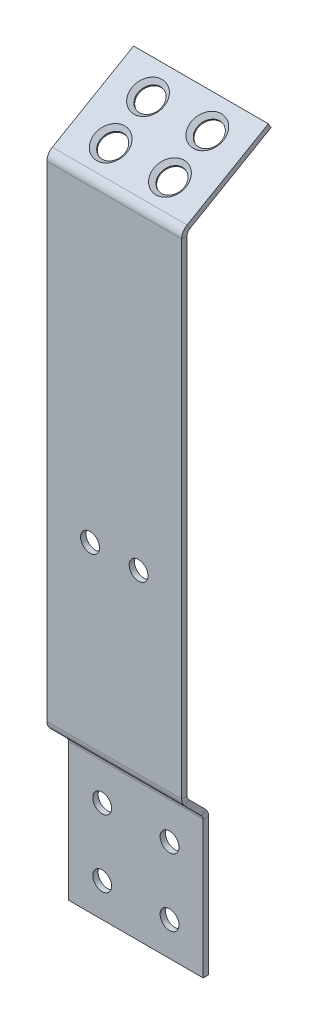
ISO-10303-21;
HEADER;
FILE_DESCRIPTION(('STEP AP214'),'2;1');
FILE_NAME('part.step','',(''),(''),'','','');
FILE_SCHEMA(('AUTOMOTIVE_DESIGN { 1 0 10303 214 1 1 1 1 }'));
ENDSEC;
DATA;
#1=APPLICATION_CONTEXT('core data for automotive mechanical design processes');
#2=APPLICATION_PROTOCOL_DEFINITION('international standard','automotive_design',2000,#1);
#3=PRODUCT_CONTEXT('',#1,'mechanical');
#4=PRODUCT('Part','Part','',(#3));
#5=PRODUCT_RELATED_PRODUCT_CATEGORY('part','',(#4));
#6=PRODUCT_DEFINITION_FORMATION('','',#4);
#7=PRODUCT_DEFINITION_CONTEXT('part definition',#1,'design');
#8=PRODUCT_DEFINITION('design','',#6,#7);
#9=PRODUCT_DEFINITION_SHAPE('','',#8);
#10=(LENGTH_UNIT() NAMED_UNIT(*) SI_UNIT(.MILLI.,.METRE.));
#11=(NAMED_UNIT(*) PLANE_ANGLE_UNIT() SI_UNIT($,.RADIAN.));
#12=(NAMED_UNIT(*) SI_UNIT($,.STERADIAN.) SOLID_ANGLE_UNIT());
#13=UNCERTAINTY_MEASURE_WITH_UNIT(LENGTH_MEASURE(1.E-05),#10,'distance_accuracy_value','');
#14=(GEOMETRIC_REPRESENTATION_CONTEXT(3) GLOBAL_UNCERTAINTY_ASSIGNED_CONTEXT((#13)) GLOBAL_UNIT_ASSIGNED_CONTEXT((#10,
#11,#12)) REPRESENTATION_CONTEXT('',''));
#15=CARTESIAN_POINT('',(0.,0.,0.));
#16=DIRECTION('',(0.,0.,1.));
#17=DIRECTION('',(1.,0.,0.));
#18=AXIS2_PLACEMENT_3D('',#15,#16,#17);
#19=CARTESIAN_POINT('',(-25.,242.195792681395,9.99999999999999));
#20=DIRECTION('',(0.,0.,-1.));
#21=DIRECTION('',(-1.,0.,0.));
#22=AXIS2_PLACEMENT_3D('',#19,#20,#21);
#23=PLANE('',#22);
#24=CARTESIAN_POINT('',(9.,127.,9.99999999999999));
#25=DIRECTION('',(0.,0.,1.));
#26=DIRECTION('',(1.,0.,0.));
#27=AXIS2_PLACEMENT_3D('',#24,#25,#26);
#28=CIRCLE('',#27,3.50000000000001);
#29=CARTESIAN_POINT('',(12.5,127.,9.99999999999999));
#30=VERTEX_POINT('',#29);
#31=EDGE_CURVE('E926',#30,#30,#28,.T.);
#32=ORIENTED_EDGE('',*,*,#31,.F.);
#33=EDGE_LOOP('',(#32));
#34=FACE_BOUND('',#33,.T.);
#35=CARTESIAN_POINT('',(-9.,127.,9.99999999999999));
#36=DIRECTION('',(0.,0.,1.));
#37=DIRECTION('',(1.,0.,0.));
#38=AXIS2_PLACEMENT_3D('',#35,#36,#37);
#39=CIRCLE('',#38,3.50000000000001);
#40=CARTESIAN_POINT('',(-5.49999999999999,127.,9.99999999999999));
#41=VERTEX_POINT('',#40);
#42=EDGE_CURVE('E928',#41,#41,#39,.T.);
#43=ORIENTED_EDGE('',*,*,#42,.F.);
#44=EDGE_LOOP('',(#43));
#45=FACE_BOUND('',#44,.T.);
#46=DIRECTION('',(0.,-1.,0.));
#47=VECTOR('',#46,1.);
#48=CARTESIAN_POINT('',(-25.,-2.80420731860514,10.));
#49=LINE('',#48,#47);
#50=CARTESIAN_POINT('',(-25.,241.535898384862,10.));
#51=VERTEX_POINT('',#50);
#52=CARTESIAN_POINT('',(-25.,61.4852813742385,10.0000000334032));
#53=VERTEX_POINT('',#52);
#54=EDGE_CURVE('E185',#51,#53,#49,.T.);
#55=ORIENTED_EDGE('',*,*,#54,.T.);
#56=DIRECTION('',(1.,0.,0.));
#57=VECTOR('',#56,1.);
#58=CARTESIAN_POINT('',(-25.,61.4852813742385,10.));
#59=LINE('',#58,#57);
#60=CARTESIAN_POINT('',(25.,61.4852813742385,10.));
#61=VERTEX_POINT('',#60);
#62=EDGE_CURVE('E173',#53,#61,#59,.T.);
#63=ORIENTED_EDGE('',*,*,#62,.T.);
#64=DIRECTION('',(0.,1.,0.));
#65=VECTOR('',#64,1.);
#66=CARTESIAN_POINT('',(25.,-2.80420731860514,10.));
#67=LINE('',#66,#65);
#68=CARTESIAN_POINT('',(25.,241.535898384862,10.));
#69=VERTEX_POINT('',#68);
#70=EDGE_CURVE('E177',#61,#69,#67,.T.);
#71=ORIENTED_EDGE('',*,*,#70,.T.);
#72=DIRECTION('',(1.,0.,0.));
#73=VECTOR('',#72,1.);
#74=CARTESIAN_POINT('',(25.,241.535898384862,10.));
#75=LINE('',#74,#73);
#76=EDGE_CURVE('E141',#69,#51,#75,.F.);
#77=ORIENTED_EDGE('',*,*,#76,.T.);
#78=EDGE_LOOP('',(#55,#63,#71,#77));
#79=FACE_BOUND('',#78,.T.);
#80=ADVANCED_FACE('F61',(#34,#45,#79),#23,.F.);
#81=CARTESIAN_POINT('',(25.,-2.80420731860514,10.));
#82=DIRECTION('',(-1.,0.,0.));
#83=DIRECTION('',(0.,0.,1.));
#84=AXIS2_PLACEMENT_3D('',#81,#82,#83);
#85=PLANE('',#84);
#86=ORIENTED_EDGE('',*,*,#70,.F.);
#87=DIRECTION('',(0.,0.,-1.));
#88=VECTOR('',#87,1.);
#89=CARTESIAN_POINT('',(25.,61.4852813742386,10.0000000000005));
#90=LINE('',#89,#88);
#91=CARTESIAN_POINT('',(25.,61.4852813742385,8.00000003340319));
#92=VERTEX_POINT('',#91);
#93=EDGE_CURVE('E13',#61,#92,#90,.T.);
#94=ORIENTED_EDGE('',*,*,#93,.T.);
#95=DIRECTION('',(0.,1.,0.));
#96=VECTOR('',#95,1.);
#97=CARTESIAN_POINT('',(25.,-2.80420731860514,8.00000000000001));
#98=LINE('',#97,#96);
#99=CARTESIAN_POINT('',(25.,241.535898384862,8.00000000000003));
#100=VERTEX_POINT('',#99);
#101=EDGE_CURVE('E182',#92,#100,#98,.T.);
#102=ORIENTED_EDGE('',*,*,#101,.T.);
#103=DIRECTION('',(0.,0.,1.));
#104=VECTOR('',#103,1.);
#105=CARTESIAN_POINT('',(25.,241.535898384862,8.00000000000003));
#106=LINE('',#105,#104);
#107=EDGE_CURVE('E236',#100,#69,#106,.T.);
#108=ORIENTED_EDGE('',*,*,#107,.T.);
#109=EDGE_LOOP('',(#86,#94,#102,#108));
#110=FACE_BOUND('',#109,.T.);
#111=ADVANCED_FACE('F63',(#110),#85,.F.);
#112=CARTESIAN_POINT('',(-25.,-2.80420731860514,10.));
#113=DIRECTION('',(1.,0.,0.));
#114=DIRECTION('',(0.,0.,-1.));
#115=AXIS2_PLACEMENT_3D('',#112,#113,#114);
#116=PLANE('',#115);
#117=DIRECTION('',(0.,-1.,0.));
#118=VECTOR('',#117,1.);
#119=CARTESIAN_POINT('',(-25.,-2.80420731860515,8.00000000000001));
#120=LINE('',#119,#118);
#121=CARTESIAN_POINT('',(-25.,241.535898384862,8.00000000000003));
#122=VERTEX_POINT('',#121);
#123=CARTESIAN_POINT('',(-24.9999999999999,61.4852813742385,8.00000003340319));
#124=VERTEX_POINT('',#123);
#125=EDGE_CURVE('E172',#122,#124,#120,.T.);
#126=ORIENTED_EDGE('',*,*,#125,.T.);
#127=DIRECTION('',(0.,0.,1.));
#128=VECTOR('',#127,1.);
#129=CARTESIAN_POINT('',(-25.,61.4852813742386,10.0000000000005));
#130=LINE('',#129,#128);
#131=EDGE_CURVE('E176',#124,#53,#130,.T.);
#132=ORIENTED_EDGE('',*,*,#131,.T.);
#133=ORIENTED_EDGE('',*,*,#54,.F.);
#134=DIRECTION('',(0.,0.,1.));
#135=VECTOR('',#134,1.);
#136=CARTESIAN_POINT('',(-25.,241.535898384862,8.00000000000003));
#137=LINE('',#136,#135);
#138=EDGE_CURVE('E318',#122,#51,#137,.T.);
#139=ORIENTED_EDGE('',*,*,#138,.F.);
#140=EDGE_LOOP('',(#126,#132,#133,#139));
#141=FACE_BOUND('',#140,.T.);
#142=ADVANCED_FACE('F362',(#141),#116,.F.);
#143=CARTESIAN_POINT('',(-25.,242.195792681395,7.99999999999999));
#144=DIRECTION('',(0.,0.,-1.));
#145=DIRECTION('',(-1.,0.,0.));
#146=AXIS2_PLACEMENT_3D('',#143,#144,#145);
#147=PLANE('',#146);
#148=CARTESIAN_POINT('',(9.,127.,7.99999999999999));
#149=DIRECTION('',(0.,0.,1.));
#150=DIRECTION('',(1.,0.,0.));
#151=AXIS2_PLACEMENT_3D('',#148,#149,#150);
#152=CIRCLE('',#151,3.50000000000001);
#153=CARTESIAN_POINT('',(12.5,127.,7.99999999999999));
#154=VERTEX_POINT('',#153);
#155=EDGE_CURVE('E379',#154,#154,#152,.T.);
#156=ORIENTED_EDGE('',*,*,#155,.T.);
#157=EDGE_LOOP('',(#156));
#158=FACE_BOUND('',#157,.T.);
#159=CARTESIAN_POINT('',(-9.,127.,7.99999999999999));
#160=DIRECTION('',(0.,0.,1.));
#161=DIRECTION('',(1.,0.,0.));
#162=AXIS2_PLACEMENT_3D('',#159,#160,#161);
#163=CIRCLE('',#162,3.50000000000001);
#164=CARTESIAN_POINT('',(-5.49999999999999,127.,7.99999999999999));
#165=VERTEX_POINT('',#164);
#166=EDGE_CURVE('E383',#165,#165,#163,.T.);
#167=ORIENTED_EDGE('',*,*,#166,.T.);
#168=EDGE_LOOP('',(#167));
#169=FACE_BOUND('',#168,.T.);
#170=DIRECTION('',(1.,0.,0.));
#171=VECTOR('',#170,1.);
#172=CARTESIAN_POINT('',(-25.,61.4852813742386,8.00000000000001));
#173=LINE('',#172,#171);
#174=EDGE_CURVE('E70',#124,#92,#173,.T.);
#175=ORIENTED_EDGE('',*,*,#174,.F.);
#176=ORIENTED_EDGE('',*,*,#125,.F.);
#177=DIRECTION('',(1.,0.,0.));
#178=VECTOR('',#177,1.);
#179=CARTESIAN_POINT('',(25.,241.535898384862,8.00000000000003));
#180=LINE('',#179,#178);
#181=EDGE_CURVE('E154',#100,#122,#180,.F.);
#182=ORIENTED_EDGE('',*,*,#181,.F.);
#183=ORIENTED_EDGE('',*,*,#101,.F.);
#184=EDGE_LOOP('',(#175,#176,#182,#183));
#185=FACE_BOUND('',#184,.T.);
#186=ADVANCED_FACE('F368',(#158,#169,#185),#147,.T.);
#187=CARTESIAN_POINT('',(-25.,241.535898384862,6.00000000000003));
#188=DIRECTION('',(-1.,0.,0.));
#189=DIRECTION('',(0.,0.,1.));
#190=AXIS2_PLACEMENT_3D('',#187,#188,#189);
#191=PLANE('',#190);
#192=DIRECTION('',(0.,-0.866025403784437,-0.500000000000004));
#193=VECTOR('',#192,1.);
#194=CARTESIAN_POINT('',(-25.,245.,8.00000000000004));
#195=LINE('',#194,#193);
#196=CARTESIAN_POINT('',(-25.,243.267949192431,7.00000000000003));
#197=VERTEX_POINT('',#196);
#198=CARTESIAN_POINT('',(-25.,245.,8.00000000000003));
#199=VERTEX_POINT('',#198);
#200=EDGE_CURVE('E170',#197,#199,#195,.F.);
#201=ORIENTED_EDGE('',*,*,#200,.F.);
#202=CARTESIAN_POINT('',(-25.,241.535898384862,6.00000000000003));
#203=DIRECTION('',(1.,0.,0.));
#204=DIRECTION('',(0.,0.,-1.));
#205=AXIS2_PLACEMENT_3D('',#202,#203,#204);
#206=CIRCLE('',#205,2.00000000000001);
#207=EDGE_CURVE('E324',#122,#197,#206,.F.);
#208=ORIENTED_EDGE('',*,*,#207,.F.);
#209=ORIENTED_EDGE('',*,*,#138,.T.);
#210=CARTESIAN_POINT('',(-25.,241.535898384862,6.00000000000003));
#211=DIRECTION('',(1.,0.,0.));
#212=DIRECTION('',(0.,0.,-1.));
#213=AXIS2_PLACEMENT_3D('',#210,#211,#212);
#214=CIRCLE('',#213,4.00000000000001);
#215=EDGE_CURVE('E148',#51,#199,#214,.F.);
#216=ORIENTED_EDGE('',*,*,#215,.T.);
#217=EDGE_LOOP('',(#201,#208,#209,#216));
#218=FACE_BOUND('',#217,.T.);
#219=ADVANCED_FACE('F336',(#218),#191,.T.);
#220=CARTESIAN_POINT('',(25.,241.535898384862,6.00000000000003));
#221=DIRECTION('',(-1.,0.,0.));
#222=DIRECTION('',(0.,0.,1.));
#223=AXIS2_PLACEMENT_3D('',#220,#221,#222);
#224=PLANE('',#223);
#225=CARTESIAN_POINT('',(25.,241.535898384862,6.00000000000003));
#226=DIRECTION('',(1.,0.,0.));
#227=DIRECTION('',(0.,0.,-1.));
#228=AXIS2_PLACEMENT_3D('',#225,#226,#227);
#229=CIRCLE('',#228,2.00000000000001);
#230=CARTESIAN_POINT('',(25.,243.267949192431,7.00000000000003));
#231=VERTEX_POINT('',#230);
#232=EDGE_CURVE('E147',#231,#100,#229,.T.);
#233=ORIENTED_EDGE('',*,*,#232,.F.);
#234=DIRECTION('',(0.,-0.866025403784437,-0.500000000000004));
#235=VECTOR('',#234,1.);
#236=CARTESIAN_POINT('',(25.,243.267949192431,7.00000000000007));
#237=LINE('',#236,#235);
#238=CARTESIAN_POINT('',(25.,245.,8.00000000000004));
#239=VERTEX_POINT('',#238);
#240=EDGE_CURVE('E144',#231,#239,#237,.F.);
#241=ORIENTED_EDGE('',*,*,#240,.T.);
#242=CARTESIAN_POINT('',(25.,241.535898384862,6.00000000000003));
#243=DIRECTION('',(1.,0.,0.));
#244=DIRECTION('',(0.,0.,-1.));
#245=AXIS2_PLACEMENT_3D('',#242,#243,#244);
#246=CIRCLE('',#245,4.00000000000001);
#247=EDGE_CURVE('E134',#239,#69,#246,.T.);
#248=ORIENTED_EDGE('',*,*,#247,.T.);
#249=ORIENTED_EDGE('',*,*,#107,.F.);
#250=EDGE_LOOP('',(#233,#241,#248,#249));
#251=FACE_BOUND('',#250,.T.);
#252=ADVANCED_FACE('F146',(#251),#224,.F.);
#253=CARTESIAN_POINT('',(25.,241.535898384862,6.00000000000003));
#254=DIRECTION('',(1.,0.,0.));
#255=DIRECTION('',(0.,0.866025403784437,0.500000000000004));
#256=AXIS2_PLACEMENT_3D('',#253,#254,#255);
#257=CYLINDRICAL_SURFACE('',#256,4.00000000000001);
#258=ORIENTED_EDGE('',*,*,#76,.F.);
#259=ORIENTED_EDGE('',*,*,#247,.F.);
#260=DIRECTION('',(1.,0.,0.));
#261=VECTOR('',#260,1.);
#262=CARTESIAN_POINT('',(-25.,245.,8.00000000000004));
#263=LINE('',#262,#261);
#264=EDGE_CURVE('E138',#239,#199,#263,.F.);
#265=ORIENTED_EDGE('',*,*,#264,.T.);
#266=ORIENTED_EDGE('',*,*,#215,.F.);
#267=EDGE_LOOP('',(#258,#259,#265,#266));
#268=FACE_BOUND('',#267,.T.);
#269=ADVANCED_FACE('F136',(#268),#257,.T.);
#270=CARTESIAN_POINT('',(25.,241.535898384862,6.00000000000003));
#271=DIRECTION('',(1.,0.,0.));
#272=DIRECTION('',(0.,0.866025403784437,0.500000000000004));
#273=AXIS2_PLACEMENT_3D('',#270,#271,#272);
#274=CYLINDRICAL_SURFACE('',#273,2.00000000000001);
#275=ORIENTED_EDGE('',*,*,#181,.T.);
#276=ORIENTED_EDGE('',*,*,#207,.T.);
#277=DIRECTION('',(1.,0.,0.));
#278=VECTOR('',#277,1.);
#279=CARTESIAN_POINT('',(-25.,243.267949192431,7.00000000000003));
#280=LINE('',#279,#278);
#281=EDGE_CURVE('E114',#197,#231,#280,.T.);
#282=ORIENTED_EDGE('',*,*,#281,.T.);
#283=ORIENTED_EDGE('',*,*,#232,.T.);
#284=EDGE_LOOP('',(#275,#276,#282,#283));
#285=FACE_BOUND('',#284,.T.);
#286=ADVANCED_FACE('F337',(#285),#274,.F.);
#287=CARTESIAN_POINT('',(25.,262.422649730811,-22.1769145362397));
#288=DIRECTION('',(-1.,0.,0.));
#289=DIRECTION('',(0.,0.,1.));
#290=AXIS2_PLACEMENT_3D('',#287,#288,#289);
#291=PLANE('',#290);
#292=ORIENTED_EDGE('',*,*,#240,.F.);
#293=DIRECTION('',(0.,-0.500000000000004,0.866025403784437));
#294=VECTOR('',#293,1.);
#295=CARTESIAN_POINT('',(25.,260.690598923242,-23.1769145362397));
#296=LINE('',#295,#294);
#297=CARTESIAN_POINT('',(25.,260.690598923242,-23.1769145362397));
#298=VERTEX_POINT('',#297);
#299=EDGE_CURVE('E106',#231,#298,#296,.F.);
#300=ORIENTED_EDGE('',*,*,#299,.T.);
#301=DIRECTION('',(0.,-0.866025403784436,-0.500000000000004));
#302=VECTOR('',#301,1.);
#303=CARTESIAN_POINT('',(25.,262.422649730811,-22.1769145362397));
#304=LINE('',#303,#302);
#305=CARTESIAN_POINT('',(25.,262.42264973081,-22.1769145362397));
#306=VERTEX_POINT('',#305);
#307=EDGE_CURVE('E157',#306,#298,#304,.T.);
#308=ORIENTED_EDGE('',*,*,#307,.F.);
#309=DIRECTION('',(0.,0.500000000000004,-0.866025403784437));
#310=VECTOR('',#309,1.);
#311=CARTESIAN_POINT('',(25.,244.42264973081,9.));
#312=LINE('',#311,#310);
#313=EDGE_CURVE('E99',#239,#306,#312,.T.);
#314=ORIENTED_EDGE('',*,*,#313,.F.);
#315=EDGE_LOOP('',(#292,#300,#308,#314));
#316=FACE_BOUND('',#315,.T.);
#317=ADVANCED_FACE('F156',(#316),#291,.F.);
#318=CARTESIAN_POINT('',(-25.,244.42264973081,9.));
#319=DIRECTION('',(1.,0.,0.));
#320=DIRECTION('',(0.,0.,-1.));
#321=AXIS2_PLACEMENT_3D('',#318,#319,#320);
#322=PLANE('',#321);
#323=ORIENTED_EDGE('',*,*,#200,.T.);
#324=DIRECTION('',(0.,-0.500000000000004,0.866025403784437));
#325=VECTOR('',#324,1.);
#326=CARTESIAN_POINT('',(-25.,244.42264973081,9.));
#327=LINE('',#326,#325);
#328=CARTESIAN_POINT('',(-25.,262.422649730811,-22.1769145362397));
#329=VERTEX_POINT('',#328);
#330=EDGE_CURVE('E153',#329,#199,#327,.T.);
#331=ORIENTED_EDGE('',*,*,#330,.F.);
#332=DIRECTION('',(0.,-0.866025403784436,-0.500000000000004));
#333=VECTOR('',#332,1.);
#334=CARTESIAN_POINT('',(-25.,262.422649730811,-22.1769145362397));
#335=LINE('',#334,#333);
#336=CARTESIAN_POINT('',(-25.,260.690598923242,-23.1769145362397));
#337=VERTEX_POINT('',#336);
#338=EDGE_CURVE('E164',#329,#337,#335,.T.);
#339=ORIENTED_EDGE('',*,*,#338,.T.);
#340=DIRECTION('',(0.,0.500000000000004,-0.866025403784437));
#341=VECTOR('',#340,1.);
#342=CARTESIAN_POINT('',(-25.,242.690598923242,8.));
#343=LINE('',#342,#341);
#344=EDGE_CURVE('E160',#337,#197,#343,.F.);
#345=ORIENTED_EDGE('',*,*,#344,.T.);
#346=EDGE_LOOP('',(#323,#331,#339,#345));
#347=FACE_BOUND('',#346,.T.);
#348=ADVANCED_FACE('F332',(#347),#322,.F.);
#349=CARTESIAN_POINT('',(-25.,244.42264973081,9.));
#350=DIRECTION('',(0.,-0.866025403784437,-0.500000000000004));
#351=DIRECTION('',(0.,0.500000000000004,-0.866025403784437));
#352=AXIS2_PLACEMENT_3D('',#349,#350,#351);
#353=PLANE('',#352);
#354=CARTESIAN_POINT('',(-11.,257.422649730811,-13.5166604983953));
#355=DIRECTION('',(0.,0.866025403784436,0.500000000000004));
#356=DIRECTION('',(0.,-0.500000000000004,0.866025403784437));
#357=AXIS2_PLACEMENT_3D('',#354,#355,#356);
#358=CIRCLE('',#357,6.);
#359=CARTESIAN_POINT('',(-11.,254.422649730811,-8.32050807568868));
#360=VERTEX_POINT('',#359);
#361=EDGE_CURVE('E956',#360,#360,#358,.T.);
#362=ORIENTED_EDGE('',*,*,#361,.F.);
#363=EDGE_LOOP('',(#362));
#364=FACE_BOUND('',#363,.T.);
#365=CARTESIAN_POINT('',(11.,257.422649730811,-13.5166604983953));
#366=DIRECTION('',(0.,0.866025403784436,0.500000000000004));
#367=DIRECTION('',(0.,-0.500000000000004,0.866025403784437));
#368=AXIS2_PLACEMENT_3D('',#365,#366,#367);
#369=CIRCLE('',#368,6.);
#370=CARTESIAN_POINT('',(11.,254.422649730811,-8.32050807568868));
#371=VERTEX_POINT('',#370);
#372=EDGE_CURVE('E209',#371,#371,#369,.T.);
#373=ORIENTED_EDGE('',*,*,#372,.F.);
#374=EDGE_LOOP('',(#373));
#375=FACE_BOUND('',#374,.T.);
#376=CARTESIAN_POINT('',(11.,249.422649730811,0.339745962155677));
#377=DIRECTION('',(0.,0.866025403784436,0.500000000000004));
#378=DIRECTION('',(0.,-0.500000000000004,0.866025403784437));
#379=AXIS2_PLACEMENT_3D('',#376,#377,#378);
#380=CIRCLE('',#379,6.);
#381=CARTESIAN_POINT('',(11.,246.42264973081,5.5358983848623));
#382=VERTEX_POINT('',#381);
#383=EDGE_CURVE('E202',#382,#382,#380,.T.);
#384=ORIENTED_EDGE('',*,*,#383,.F.);
#385=EDGE_LOOP('',(#384));
#386=FACE_BOUND('',#385,.T.);
#387=CARTESIAN_POINT('',(-11.,249.422649730811,0.339745962155677));
#388=DIRECTION('',(0.,0.866025403784436,0.500000000000004));
#389=DIRECTION('',(0.,-0.500000000000004,0.866025403784437));
#390=AXIS2_PLACEMENT_3D('',#387,#388,#389);
#391=CIRCLE('',#390,6.);
#392=CARTESIAN_POINT('',(-11.,246.42264973081,5.5358983848623));
#393=VERTEX_POINT('',#392);
#394=EDGE_CURVE('E198',#393,#393,#391,.T.);
#395=ORIENTED_EDGE('',*,*,#394,.F.);
#396=EDGE_LOOP('',(#395));
#397=FACE_BOUND('',#396,.T.);
#398=ORIENTED_EDGE('',*,*,#264,.F.);
#399=ORIENTED_EDGE('',*,*,#313,.T.);
#400=DIRECTION('',(-1.,0.,0.));
#401=VECTOR('',#400,1.);
#402=CARTESIAN_POINT('',(-25.,262.42264973081,-22.1769145362397));
#403=LINE('',#402,#401);
#404=EDGE_CURVE('E159',#306,#329,#403,.T.);
#405=ORIENTED_EDGE('',*,*,#404,.T.);
#406=ORIENTED_EDGE('',*,*,#330,.T.);
#407=EDGE_LOOP('',(#398,#399,#405,#406));
#408=FACE_BOUND('',#407,.T.);
#409=ADVANCED_FACE('F151',(#364,#375,#386,#397,#408),#353,.F.);
#410=CARTESIAN_POINT('',(-25.,242.690598923242,8.));
#411=DIRECTION('',(0.,-0.866025403784437,-0.500000000000004));
#412=DIRECTION('',(0.,0.500000000000004,-0.866025403784437));
#413=AXIS2_PLACEMENT_3D('',#410,#411,#412);
#414=PLANE('',#413);
#415=CARTESIAN_POINT('',(-11.,255.690598923242,-14.5166604983954));
#416=DIRECTION('',(0.,-0.866025403784437,-0.500000000000004));
#417=DIRECTION('',(0.,0.500000000000004,-0.866025403784436));
#418=AXIS2_PLACEMENT_3D('',#415,#416,#417);
#419=CIRCLE('',#418,4.49999999999999);
#420=CARTESIAN_POINT('',(-11.,257.940598923242,-18.4137748154253));
#421=VERTEX_POINT('',#420);
#422=EDGE_CURVE('E65',#421,#421,#419,.T.);
#423=ORIENTED_EDGE('',*,*,#422,.F.);
#424=EDGE_LOOP('',(#423));
#425=FACE_BOUND('',#424,.T.);
#426=CARTESIAN_POINT('',(11.,255.690598923242,-14.5166604983954));
#427=DIRECTION('',(0.,-0.866025403784437,-0.500000000000004));
#428=DIRECTION('',(0.,0.500000000000004,-0.866025403784436));
#429=AXIS2_PLACEMENT_3D('',#426,#427,#428);
#430=CIRCLE('',#429,4.49999999999999);
#431=CARTESIAN_POINT('',(11.,257.940598923242,-18.4137748154253));
#432=VERTEX_POINT('',#431);
#433=EDGE_CURVE('E200',#432,#432,#430,.T.);
#434=ORIENTED_EDGE('',*,*,#433,.F.);
#435=EDGE_LOOP('',(#434));
#436=FACE_BOUND('',#435,.T.);
#437=CARTESIAN_POINT('',(11.,247.690598923242,-0.660254037844378));
#438=DIRECTION('',(0.,-0.866025403784437,-0.500000000000004));
#439=DIRECTION('',(0.,0.500000000000004,-0.866025403784436));
#440=AXIS2_PLACEMENT_3D('',#437,#438,#439);
#441=CIRCLE('',#440,4.49999999999999);
#442=CARTESIAN_POINT('',(11.,249.940598923242,-4.55736835487433));
#443=VERTEX_POINT('',#442);
#444=EDGE_CURVE('E196',#443,#443,#441,.T.);
#445=ORIENTED_EDGE('',*,*,#444,.F.);
#446=EDGE_LOOP('',(#445));
#447=FACE_BOUND('',#446,.T.);
#448=CARTESIAN_POINT('',(-11.,247.690598923242,-0.660254037844378));
#449=DIRECTION('',(0.,-0.866025403784437,-0.500000000000004));
#450=DIRECTION('',(0.,0.500000000000004,-0.866025403784436));
#451=AXIS2_PLACEMENT_3D('',#448,#449,#450);
#452=CIRCLE('',#451,4.49999999999999);
#453=CARTESIAN_POINT('',(-11.,249.940598923242,-4.55736835487433));
#454=VERTEX_POINT('',#453);
#455=EDGE_CURVE('E191',#454,#454,#452,.T.);
#456=ORIENTED_EDGE('',*,*,#455,.F.);
#457=EDGE_LOOP('',(#456));
#458=FACE_BOUND('',#457,.T.);
#459=ORIENTED_EDGE('',*,*,#299,.F.);
#460=ORIENTED_EDGE('',*,*,#281,.F.);
#461=ORIENTED_EDGE('',*,*,#344,.F.);
#462=DIRECTION('',(1.,0.,0.));
#463=VECTOR('',#462,1.);
#464=CARTESIAN_POINT('',(-25.,260.690598923242,-23.1769145362397));
#465=LINE('',#464,#463);
#466=EDGE_CURVE('E87',#298,#337,#465,.F.);
#467=ORIENTED_EDGE('',*,*,#466,.F.);
#468=EDGE_LOOP('',(#459,#460,#461,#467));
#469=FACE_BOUND('',#468,.T.);
#470=ADVANCED_FACE('F340',(#425,#436,#447,#458,#469),#414,.T.);
#471=CARTESIAN_POINT('',(-25.,262.422649730811,-22.1769145362397));
#472=DIRECTION('',(0.,-0.500000000000004,0.866025403784436));
#473=DIRECTION('',(0.,-0.866025403784436,-0.500000000000004));
#474=AXIS2_PLACEMENT_3D('',#471,#472,#473);
#475=PLANE('',#474);
#476=ORIENTED_EDGE('',*,*,#466,.T.);
#477=ORIENTED_EDGE('',*,*,#338,.F.);
#478=ORIENTED_EDGE('',*,*,#404,.F.);
#479=ORIENTED_EDGE('',*,*,#307,.T.);
#480=EDGE_LOOP('',(#476,#477,#478,#479));
#481=FACE_BOUND('',#480,.T.);
#482=ADVANCED_FACE('F342',(#481),#475,.F.);
#483=CARTESIAN_POINT('',(-25.,0.,2.));
#484=DIRECTION('',(0.,1.,0.));
#485=DIRECTION('',(0.,0.,1.));
#486=AXIS2_PLACEMENT_3D('',#483,#484,#485);
#487=PLANE('',#486);
#488=DIRECTION('',(1.,0.,0.));
#489=VECTOR('',#488,1.);
#490=CARTESIAN_POINT('',(-25.,0.,0.));
#491=LINE('',#490,#489);
#492=CARTESIAN_POINT('',(-25.,0.,0.));
#493=VERTEX_POINT('',#492);
#494=CARTESIAN_POINT('',(25.,0.,0.));
#495=VERTEX_POINT('',#494);
#496=EDGE_CURVE('E306',#493,#495,#491,.T.);
#497=ORIENTED_EDGE('',*,*,#496,.T.);
#498=DIRECTION('',(0.,0.,-1.));
#499=VECTOR('',#498,1.);
#500=CARTESIAN_POINT('',(25.,0.,2.));
#501=LINE('',#500,#499);
#502=CARTESIAN_POINT('',(25.,0.,2.));
#503=VERTEX_POINT('',#502);
#504=EDGE_CURVE('E300',#503,#495,#501,.T.);
#505=ORIENTED_EDGE('',*,*,#504,.F.);
#506=DIRECTION('',(1.,0.,0.));
#507=VECTOR('',#506,1.);
#508=CARTESIAN_POINT('',(-25.,0.,2.));
#509=LINE('',#508,#507);
#510=CARTESIAN_POINT('',(-25.,0.,2.));
#511=VERTEX_POINT('',#510);
#512=EDGE_CURVE('E285',#511,#503,#509,.T.);
#513=ORIENTED_EDGE('',*,*,#512,.F.);
#514=DIRECTION('',(0.,0.,-1.));
#515=VECTOR('',#514,1.);
#516=CARTESIAN_POINT('',(-25.,0.,2.));
#517=LINE('',#516,#515);
#518=EDGE_CURVE('E303',#511,#493,#517,.T.);
#519=ORIENTED_EDGE('',*,*,#518,.T.);
#520=EDGE_LOOP('',(#497,#505,#513,#519));
#521=FACE_BOUND('',#520,.T.);
#522=ADVANCED_FACE('F349',(#521),#487,.F.);
#523=CARTESIAN_POINT('',(25.,0.,2.));
#524=DIRECTION('',(-1.,0.,0.));
#525=DIRECTION('',(0.,0.,1.));
#526=AXIS2_PLACEMENT_3D('',#523,#524,#525);
#527=PLANE('',#526);
#528=DIRECTION('',(0.,0.,-1.));
#529=VECTOR('',#528,1.);
#530=CARTESIAN_POINT('',(25.,51.,2.00000000000036));
#531=LINE('',#530,#529);
#532=CARTESIAN_POINT('',(25.,51.,2.));
#533=VERTEX_POINT('',#532);
#534=CARTESIAN_POINT('',(25.,51.,0.));
#535=VERTEX_POINT('',#534);
#536=EDGE_CURVE('E276',#533,#535,#531,.T.);
#537=ORIENTED_EDGE('',*,*,#536,.F.);
#538=DIRECTION('',(0.,1.,0.));
#539=VECTOR('',#538,1.);
#540=CARTESIAN_POINT('',(25.,0.,2.));
#541=LINE('',#540,#539);
#542=EDGE_CURVE('E282',#503,#533,#541,.T.);
#543=ORIENTED_EDGE('',*,*,#542,.F.);
#544=ORIENTED_EDGE('',*,*,#504,.T.);
#545=DIRECTION('',(0.,1.,0.));
#546=VECTOR('',#545,1.);
#547=CARTESIAN_POINT('',(25.,0.,0.));
#548=LINE('',#547,#546);
#549=EDGE_CURVE('E297',#495,#535,#548,.T.);
#550=ORIENTED_EDGE('',*,*,#549,.T.);
#551=EDGE_LOOP('',(#537,#543,#544,#550));
#552=FACE_BOUND('',#551,.T.);
#553=ADVANCED_FACE('F453',(#552),#527,.F.);
#554=CARTESIAN_POINT('',(-25.,245.,0.));
#555=DIRECTION('',(0.,0.,-1.));
#556=DIRECTION('',(-1.,0.,0.));
#557=AXIS2_PLACEMENT_3D('',#554,#555,#556);
#558=PLANE('',#557);
#559=CARTESIAN_POINT('',(12.5,37.5,0.));
#560=DIRECTION('',(0.,0.,1.));
#561=DIRECTION('',(1.,0.,0.));
#562=AXIS2_PLACEMENT_3D('',#559,#560,#561);
#563=CIRCLE('',#562,3.5);
#564=CARTESIAN_POINT('',(16.,37.5,0.));
#565=VERTEX_POINT('',#564);
#566=EDGE_CURVE('E935',#565,#565,#563,.T.);
#567=ORIENTED_EDGE('',*,*,#566,.T.);
#568=EDGE_LOOP('',(#567));
#569=FACE_BOUND('',#568,.T.);
#570=CARTESIAN_POINT('',(12.5,12.5,0.));
#571=DIRECTION('',(0.,0.,1.));
#572=DIRECTION('',(1.,0.,0.));
#573=AXIS2_PLACEMENT_3D('',#570,#571,#572);
#574=CIRCLE('',#573,3.5);
#575=CARTESIAN_POINT('',(16.,12.5,0.));
#576=VERTEX_POINT('',#575);
#577=EDGE_CURVE('E941',#576,#576,#574,.T.);
#578=ORIENTED_EDGE('',*,*,#577,.T.);
#579=EDGE_LOOP('',(#578));
#580=FACE_BOUND('',#579,.T.);
#581=CARTESIAN_POINT('',(-12.5,12.5,0.));
#582=DIRECTION('',(0.,0.,1.));
#583=DIRECTION('',(1.,0.,0.));
#584=AXIS2_PLACEMENT_3D('',#581,#582,#583);
#585=CIRCLE('',#584,3.5);
#586=CARTESIAN_POINT('',(-9.,12.5,0.));
#587=VERTEX_POINT('',#586);
#588=EDGE_CURVE('E947',#587,#587,#585,.T.);
#589=ORIENTED_EDGE('',*,*,#588,.T.);
#590=EDGE_LOOP('',(#589));
#591=FACE_BOUND('',#590,.T.);
#592=CARTESIAN_POINT('',(-12.5,37.5,0.));
#593=DIRECTION('',(0.,0.,1.));
#594=DIRECTION('',(1.,0.,0.));
#595=AXIS2_PLACEMENT_3D('',#592,#593,#594);
#596=CIRCLE('',#595,3.5);
#597=CARTESIAN_POINT('',(-8.99999999999999,37.5,0.));
#598=VERTEX_POINT('',#597);
#599=EDGE_CURVE('E953',#598,#598,#596,.T.);
#600=ORIENTED_EDGE('',*,*,#599,.T.);
#601=EDGE_LOOP('',(#600));
#602=FACE_BOUND('',#601,.T.);
#603=DIRECTION('',(0.,-1.,0.));
#604=VECTOR('',#603,1.);
#605=CARTESIAN_POINT('',(-25.,0.,0.));
#606=LINE('',#605,#604);
#607=CARTESIAN_POINT('',(-25.,51.,0.));
#608=VERTEX_POINT('',#607);
#609=EDGE_CURVE('E291',#608,#493,#606,.T.);
#610=ORIENTED_EDGE('',*,*,#609,.F.);
#611=DIRECTION('',(1.,0.,0.));
#612=VECTOR('',#611,1.);
#613=CARTESIAN_POINT('',(-25.,51.,0.));
#614=LINE('',#613,#612);
#615=EDGE_CURVE('E294',#608,#535,#614,.T.);
#616=ORIENTED_EDGE('',*,*,#615,.T.);
#617=ORIENTED_EDGE('',*,*,#549,.F.);
#618=ORIENTED_EDGE('',*,*,#496,.F.);
#619=EDGE_LOOP('',(#610,#616,#617,#618));
#620=FACE_BOUND('',#619,.T.);
#621=ADVANCED_FACE('F480',(#569,#580,#591,#602,#620),#558,.T.);
#622=CARTESIAN_POINT('',(-25.,0.,2.));
#623=DIRECTION('',(1.,0.,0.));
#624=DIRECTION('',(0.,0.,-1.));
#625=AXIS2_PLACEMENT_3D('',#622,#623,#624);
#626=PLANE('',#625);
#627=DIRECTION('',(0.,0.,1.));
#628=VECTOR('',#627,1.);
#629=CARTESIAN_POINT('',(-25.,51.,2.00000000000036));
#630=LINE('',#629,#628);
#631=CARTESIAN_POINT('',(-25.,51.,1.99999996952845));
#632=VERTEX_POINT('',#631);
#633=EDGE_CURVE('E267',#608,#632,#630,.T.);
#634=ORIENTED_EDGE('',*,*,#633,.F.);
#635=ORIENTED_EDGE('',*,*,#609,.T.);
#636=ORIENTED_EDGE('',*,*,#518,.F.);
#637=DIRECTION('',(0.,-1.,0.));
#638=VECTOR('',#637,1.);
#639=CARTESIAN_POINT('',(-25.,0.,2.));
#640=LINE('',#639,#638);
#641=EDGE_CURVE('E288',#632,#511,#640,.T.);
#642=ORIENTED_EDGE('',*,*,#641,.F.);
#643=EDGE_LOOP('',(#634,#635,#636,#642));
#644=FACE_BOUND('',#643,.T.);
#645=ADVANCED_FACE('F474',(#644),#626,.F.);
#646=CARTESIAN_POINT('',(-25.,245.,2.));
#647=DIRECTION('',(0.,0.,-1.));
#648=DIRECTION('',(-1.,0.,0.));
#649=AXIS2_PLACEMENT_3D('',#646,#647,#648);
#650=PLANE('',#649);
#651=CARTESIAN_POINT('',(12.5,37.5,2.));
#652=DIRECTION('',(0.,0.,1.));
#653=DIRECTION('',(1.,0.,0.));
#654=AXIS2_PLACEMENT_3D('',#651,#652,#653);
#655=CIRCLE('',#654,3.5);
#656=CARTESIAN_POINT('',(16.,37.5,2.));
#657=VERTEX_POINT('',#656);
#658=EDGE_CURVE('E932',#657,#657,#655,.T.);
#659=ORIENTED_EDGE('',*,*,#658,.F.);
#660=EDGE_LOOP('',(#659));
#661=FACE_BOUND('',#660,.T.);
#662=CARTESIAN_POINT('',(12.5,12.5,2.));
#663=DIRECTION('',(0.,0.,1.));
#664=DIRECTION('',(1.,0.,0.));
#665=AXIS2_PLACEMENT_3D('',#662,#663,#664);
#666=CIRCLE('',#665,3.5);
#667=CARTESIAN_POINT('',(16.,12.5,2.));
#668=VERTEX_POINT('',#667);
#669=EDGE_CURVE('E938',#668,#668,#666,.T.);
#670=ORIENTED_EDGE('',*,*,#669,.F.);
#671=EDGE_LOOP('',(#670));
#672=FACE_BOUND('',#671,.T.);
#673=CARTESIAN_POINT('',(-12.5,12.5,2.));
#674=DIRECTION('',(0.,0.,1.));
#675=DIRECTION('',(1.,0.,0.));
#676=AXIS2_PLACEMENT_3D('',#673,#674,#675);
#677=CIRCLE('',#676,3.5);
#678=CARTESIAN_POINT('',(-9.,12.5,2.));
#679=VERTEX_POINT('',#678);
#680=EDGE_CURVE('E944',#679,#679,#677,.T.);
#681=ORIENTED_EDGE('',*,*,#680,.F.);
#682=EDGE_LOOP('',(#681));
#683=FACE_BOUND('',#682,.T.);
#684=CARTESIAN_POINT('',(-12.5,37.5,2.));
#685=DIRECTION('',(0.,0.,1.));
#686=DIRECTION('',(1.,0.,0.));
#687=AXIS2_PLACEMENT_3D('',#684,#685,#686);
#688=CIRCLE('',#687,3.5);
#689=CARTESIAN_POINT('',(-8.99999999999999,37.5,2.));
#690=VERTEX_POINT('',#689);
#691=EDGE_CURVE('E950',#690,#690,#688,.T.);
#692=ORIENTED_EDGE('',*,*,#691,.F.);
#693=EDGE_LOOP('',(#692));
#694=FACE_BOUND('',#693,.T.);
#695=DIRECTION('',(1.,0.,0.));
#696=VECTOR('',#695,1.);
#697=CARTESIAN_POINT('',(-25.,51.,2.));
#698=LINE('',#697,#696);
#699=EDGE_CURVE('E264',#632,#533,#698,.T.);
#700=ORIENTED_EDGE('',*,*,#699,.F.);
#701=ORIENTED_EDGE('',*,*,#641,.T.);
#702=ORIENTED_EDGE('',*,*,#512,.T.);
#703=ORIENTED_EDGE('',*,*,#542,.T.);
#704=EDGE_LOOP('',(#700,#701,#702,#703));
#705=FACE_BOUND('',#704,.T.);
#706=ADVANCED_FACE('F464',(#661,#672,#683,#694,#705),#650,.F.);
#707=CARTESIAN_POINT('',(25.,51.,4.00000003569965));
#708=DIRECTION('',(-1.,0.,0.));
#709=DIRECTION('',(0.,0.,1.));
#710=AXIS2_PLACEMENT_3D('',#707,#708,#709);
#711=PLANE('',#710);
#712=CARTESIAN_POINT('',(25.,51.,4.));
#713=DIRECTION('',(-1.,0.,0.));
#714=DIRECTION('',(0.,-1.,0.));
#715=AXIS2_PLACEMENT_3D('',#712,#713,#714);
#716=CIRCLE('',#715,4.00000003569965);
#717=CARTESIAN_POINT('',(25.,53.8284271499896,1.17157285001035));
#718=VERTEX_POINT('',#717);
#719=EDGE_CURVE('E279',#535,#718,#716,.F.);
#720=ORIENTED_EDGE('',*,*,#719,.T.);
#721=DIRECTION('',(0.,0.707106781186554,-0.707106781186541));
#722=VECTOR('',#721,1.);
#723=CARTESIAN_POINT('',(25.,52.4142135623728,2.58578643762718));
#724=LINE('',#723,#722);
#725=CARTESIAN_POINT('',(25.,52.4142135623731,2.58578643762691));
#726=VERTEX_POINT('',#725);
#727=EDGE_CURVE('E237',#726,#718,#724,.T.);
#728=ORIENTED_EDGE('',*,*,#727,.F.);
#729=CARTESIAN_POINT('',(25.,51.,4.00000003569965));
#730=DIRECTION('',(1.,0.,0.));
#731=DIRECTION('',(0.,0.,-1.));
#732=AXIS2_PLACEMENT_3D('',#729,#730,#731);
#733=CIRCLE('',#732,2.0000000661712);
#734=EDGE_CURVE('E261',#533,#726,#733,.T.);
#735=ORIENTED_EDGE('',*,*,#734,.F.);
#736=ORIENTED_EDGE('',*,*,#536,.T.);
#737=EDGE_LOOP('',(#720,#728,#735,#736));
#738=FACE_BOUND('',#737,.T.);
#739=ADVANCED_FACE('F446',(#738),#711,.F.);
#740=CARTESIAN_POINT('',(50.0896722646355,51.,4.));
#741=DIRECTION('',(-1.,0.,0.));
#742=DIRECTION('',(0.,-1.,0.));
#743=AXIS2_PLACEMENT_3D('',#740,#741,#742);
#744=CYLINDRICAL_SURFACE('',#743,4.00000003569965);
#745=ORIENTED_EDGE('',*,*,#615,.F.);
#746=CARTESIAN_POINT('',(-25.,51.,4.));
#747=DIRECTION('',(-1.,0.,0.));
#748=DIRECTION('',(0.,-1.,0.));
#749=AXIS2_PLACEMENT_3D('',#746,#747,#748);
#750=CIRCLE('',#749,4.00000003569965);
#751=CARTESIAN_POINT('',(-25.,53.8284271499896,1.17157285001035));
#752=VERTEX_POINT('',#751);
#753=EDGE_CURVE('E270',#752,#608,#750,.T.);
#754=ORIENTED_EDGE('',*,*,#753,.F.);
#755=DIRECTION('',(1.,0.,0.));
#756=VECTOR('',#755,1.);
#757=CARTESIAN_POINT('',(-25.,53.8284271247462,1.17157287525384));
#758=LINE('',#757,#756);
#759=EDGE_CURVE('E273',#752,#718,#758,.T.);
#760=ORIENTED_EDGE('',*,*,#759,.T.);
#761=ORIENTED_EDGE('',*,*,#719,.F.);
#762=EDGE_LOOP('',(#745,#754,#760,#761));
#763=FACE_BOUND('',#762,.T.);
#764=ADVANCED_FACE('F440',(#763),#744,.T.);
#765=CARTESIAN_POINT('',(-25.,51.,4.00000003569965));
#766=DIRECTION('',(1.,0.,0.));
#767=DIRECTION('',(0.,0.,-1.));
#768=AXIS2_PLACEMENT_3D('',#765,#766,#767);
#769=PLANE('',#768);
#770=DIRECTION('',(0.,-0.707106781186554,0.707106781186541));
#771=VECTOR('',#770,1.);
#772=CARTESIAN_POINT('',(-25.,52.4142135623728,2.58578643762718));
#773=LINE('',#772,#771);
#774=CARTESIAN_POINT('',(-25.,52.4142135876165,2.58578641238345));
#775=VERTEX_POINT('',#774);
#776=EDGE_CURVE('E243',#752,#775,#773,.T.);
#777=ORIENTED_EDGE('',*,*,#776,.F.);
#778=ORIENTED_EDGE('',*,*,#753,.T.);
#779=ORIENTED_EDGE('',*,*,#633,.T.);
#780=CARTESIAN_POINT('',(-25.,51.,4.00000003569965));
#781=DIRECTION('',(-1.,0.,0.));
#782=DIRECTION('',(0.,0.,1.));
#783=AXIS2_PLACEMENT_3D('',#780,#781,#782);
#784=CIRCLE('',#783,2.0000000661712);
#785=EDGE_CURVE('E258',#775,#632,#784,.T.);
#786=ORIENTED_EDGE('',*,*,#785,.F.);
#787=EDGE_LOOP('',(#777,#778,#779,#786));
#788=FACE_BOUND('',#787,.T.);
#789=ADVANCED_FACE('F472',(#788),#769,.F.);
#790=CARTESIAN_POINT('',(50.0896722646355,51.,4.));
#791=DIRECTION('',(-1.,0.,0.));
#792=DIRECTION('',(0.,-1.,0.));
#793=AXIS2_PLACEMENT_3D('',#790,#791,#792);
#794=CYLINDRICAL_SURFACE('',#793,2.00000003569965);
#795=ORIENTED_EDGE('',*,*,#699,.T.);
#796=ORIENTED_EDGE('',*,*,#734,.T.);
#797=DIRECTION('',(1.,0.,0.));
#798=VECTOR('',#797,1.);
#799=CARTESIAN_POINT('',(-25.,52.4142135623731,2.58578643762691));
#800=LINE('',#799,#798);
#801=EDGE_CURVE('E252',#775,#726,#800,.T.);
#802=ORIENTED_EDGE('',*,*,#801,.F.);
#803=ORIENTED_EDGE('',*,*,#785,.T.);
#804=EDGE_LOOP('',(#795,#796,#802,#803));
#805=FACE_BOUND('',#804,.T.);
#806=ADVANCED_FACE('F459',(#805),#794,.F.);
#807=CARTESIAN_POINT('',(-25.,188.015705669517,138.187278544771));
#808=DIRECTION('',(0.,0.707106781186549,-0.707106781186546));
#809=DIRECTION('',(-1.,0.,0.));
#810=AXIS2_PLACEMENT_3D('',#807,#808,#809);
#811=PLANE('',#810);
#812=DIRECTION('',(1.,0.,0.));
#813=VECTOR('',#812,1.);
#814=CARTESIAN_POINT('',(-25.,58.6568542494924,8.8284271247462));
#815=LINE('',#814,#813);
#816=CARTESIAN_POINT('',(-25.,58.6568542293318,8.82842714490681));
#817=VERTEX_POINT('',#816);
#818=CARTESIAN_POINT('',(25.,58.6568542494924,8.82842712474621));
#819=VERTEX_POINT('',#818);
#820=EDGE_CURVE('E228',#817,#819,#815,.T.);
#821=ORIENTED_EDGE('',*,*,#820,.F.);
#822=DIRECTION('',(0.,-0.707106781186546,-0.707106781186549));
#823=VECTOR('',#822,1.);
#824=CARTESIAN_POINT('',(-25.,14.774544278813,-35.0538828459333));
#825=LINE('',#824,#823);
#826=EDGE_CURVE('E255',#817,#775,#825,.T.);
#827=ORIENTED_EDGE('',*,*,#826,.T.);
#828=ORIENTED_EDGE('',*,*,#801,.T.);
#829=DIRECTION('',(0.,0.707106781186546,0.707106781186549));
#830=VECTOR('',#829,1.);
#831=CARTESIAN_POINT('',(25.,14.774544278813,-35.0538828459333));
#832=LINE('',#831,#830);
#833=EDGE_CURVE('E249',#726,#819,#832,.T.);
#834=ORIENTED_EDGE('',*,*,#833,.T.);
#835=EDGE_LOOP('',(#821,#827,#828,#834));
#836=FACE_BOUND('',#835,.T.);
#837=ADVANCED_FACE('F417',(#836),#811,.F.);
#838=CARTESIAN_POINT('',(-25.,14.774544278813,-35.0538828459333));
#839=DIRECTION('',(1.,0.,0.));
#840=DIRECTION('',(0.,0.707106781186549,-0.707106781186546));
#841=AXIS2_PLACEMENT_3D('',#838,#839,#840);
#842=PLANE('',#841);
#843=DIRECTION('',(0.,-0.707106781186554,0.707106781186541));
#844=VECTOR('',#843,1.);
#845=CARTESIAN_POINT('',(-25.,58.6568542494921,8.82842712474652));
#846=LINE('',#845,#844);
#847=CARTESIAN_POINT('',(-25.,60.0710678118655,7.41421356237313));
#848=VERTEX_POINT('',#847);
#849=EDGE_CURVE('E309',#848,#817,#846,.T.);
#850=ORIENTED_EDGE('',*,*,#849,.F.);
#851=DIRECTION('',(0.,-0.707106781186546,-0.707106781186549));
#852=VECTOR('',#851,1.);
#853=CARTESIAN_POINT('',(-25.,16.1887578411861,-36.4680964083064));
#854=LINE('',#853,#852);
#855=EDGE_CURVE('E246',#848,#752,#854,.T.);
#856=ORIENTED_EDGE('',*,*,#855,.T.);
#857=ORIENTED_EDGE('',*,*,#776,.T.);
#858=ORIENTED_EDGE('',*,*,#826,.F.);
#859=EDGE_LOOP('',(#850,#856,#857,#858));
#860=FACE_BOUND('',#859,.T.);
#861=ADVANCED_FACE('F425',(#860),#842,.F.);
#862=CARTESIAN_POINT('',(-25.,189.42991923189,136.773064982398));
#863=DIRECTION('',(0.,0.707106781186549,-0.707106781186546));
#864=DIRECTION('',(-1.,0.,0.));
#865=AXIS2_PLACEMENT_3D('',#862,#863,#864);
#866=PLANE('',#865);
#867=ORIENTED_EDGE('',*,*,#855,.F.);
#868=DIRECTION('',(1.,0.,0.));
#869=VECTOR('',#868,1.);
#870=CARTESIAN_POINT('',(-25.,60.0710678118655,7.41421356237313));
#871=LINE('',#870,#869);
#872=CARTESIAN_POINT('',(25.,60.0710678118655,7.41421356237313));
#873=VERTEX_POINT('',#872);
#874=EDGE_CURVE('E240',#848,#873,#871,.T.);
#875=ORIENTED_EDGE('',*,*,#874,.T.);
#876=DIRECTION('',(0.,0.707106781186546,0.707106781186549));
#877=VECTOR('',#876,1.);
#878=CARTESIAN_POINT('',(25.,16.1887578411861,-36.4680964083064));
#879=LINE('',#878,#877);
#880=EDGE_CURVE('E233',#718,#873,#879,.T.);
#881=ORIENTED_EDGE('',*,*,#880,.F.);
#882=ORIENTED_EDGE('',*,*,#759,.F.);
#883=EDGE_LOOP('',(#867,#875,#881,#882));
#884=FACE_BOUND('',#883,.T.);
#885=ADVANCED_FACE('F432',(#884),#866,.T.);
#886=CARTESIAN_POINT('',(25.,14.774544278813,-35.0538828459333));
#887=DIRECTION('',(-1.,0.,0.));
#888=DIRECTION('',(0.,-0.707106781186549,0.707106781186546));
#889=AXIS2_PLACEMENT_3D('',#886,#887,#888);
#890=PLANE('',#889);
#891=DIRECTION('',(0.,0.707106781186554,-0.707106781186541));
#892=VECTOR('',#891,1.);
#893=CARTESIAN_POINT('',(25.,58.6568542494921,8.82842712474652));
#894=LINE('',#893,#892);
#895=EDGE_CURVE('E312',#819,#873,#894,.T.);
#896=ORIENTED_EDGE('',*,*,#895,.F.);
#897=ORIENTED_EDGE('',*,*,#833,.F.);
#898=ORIENTED_EDGE('',*,*,#727,.T.);
#899=ORIENTED_EDGE('',*,*,#880,.T.);
#900=EDGE_LOOP('',(#896,#897,#898,#899));
#901=FACE_BOUND('',#900,.T.);
#902=ADVANCED_FACE('F408',(#901),#890,.F.);
#903=CARTESIAN_POINT('',(-25.,61.4852813978582,5.9999999763804));
#904=DIRECTION('',(-1.,0.,0.));
#905=DIRECTION('',(0.,0.,1.));
#906=AXIS2_PLACEMENT_3D('',#903,#904,#905);
#907=PLANE('',#906);
#908=ORIENTED_EDGE('',*,*,#131,.F.);
#909=CARTESIAN_POINT('',(-24.9999999999999,61.4852813742385,6.00000000000001));
#910=DIRECTION('',(-1.,0.,0.));
#911=DIRECTION('',(0.,-1.,0.));
#912=AXIS2_PLACEMENT_3D('',#909,#910,#911);
#913=CIRCLE('',#912,2.00000003340318);
#914=EDGE_CURVE('E194',#124,#848,#913,.F.);
#915=ORIENTED_EDGE('',*,*,#914,.T.);
#916=ORIENTED_EDGE('',*,*,#849,.T.);
#917=CARTESIAN_POINT('',(-25.,61.4852813978582,5.9999999763804));
#918=DIRECTION('',(1.,0.,0.));
#919=DIRECTION('',(0.,0.,-1.));
#920=AXIS2_PLACEMENT_3D('',#917,#918,#919);
#921=CIRCLE('',#920,4.00000006191458);
#922=EDGE_CURVE('E223',#53,#817,#921,.T.);
#923=ORIENTED_EDGE('',*,*,#922,.F.);
#924=EDGE_LOOP('',(#908,#915,#916,#923));
#925=FACE_BOUND('',#924,.T.);
#926=ADVANCED_FACE('F423',(#925),#907,.T.);
#927=CARTESIAN_POINT('',(25.,61.4852813978582,5.9999999763804));
#928=DIRECTION('',(1.,0.,0.));
#929=DIRECTION('',(0.,0.,-1.));
#930=AXIS2_PLACEMENT_3D('',#927,#928,#929);
#931=PLANE('',#930);
#932=CARTESIAN_POINT('',(25.,61.4852813742385,6.00000000000001));
#933=DIRECTION('',(-1.,0.,0.));
#934=DIRECTION('',(0.,-1.,0.));
#935=AXIS2_PLACEMENT_3D('',#932,#933,#934);
#936=CIRCLE('',#935,2.00000003340318);
#937=EDGE_CURVE('E226',#873,#92,#936,.T.);
#938=ORIENTED_EDGE('',*,*,#937,.T.);
#939=ORIENTED_EDGE('',*,*,#93,.F.);
#940=CARTESIAN_POINT('',(25.,61.4852813978582,5.9999999763804));
#941=DIRECTION('',(-1.,0.,0.));
#942=DIRECTION('',(0.,0.,1.));
#943=AXIS2_PLACEMENT_3D('',#940,#941,#942);
#944=CIRCLE('',#943,4.00000006191458);
#945=EDGE_CURVE('E78',#819,#61,#944,.T.);
#946=ORIENTED_EDGE('',*,*,#945,.F.);
#947=ORIENTED_EDGE('',*,*,#895,.T.);
#948=EDGE_LOOP('',(#938,#939,#946,#947));
#949=FACE_BOUND('',#948,.T.);
#950=ADVANCED_FACE('F401',(#949),#931,.T.);
#951=CARTESIAN_POINT('',(50.1786547320151,61.4852813742386,6.00000000000001));
#952=DIRECTION('',(-1.,0.,0.));
#953=DIRECTION('',(0.,-1.,0.));
#954=AXIS2_PLACEMENT_3D('',#951,#952,#953);
#955=CYLINDRICAL_SURFACE('',#954,4.00000003340318);
#956=ORIENTED_EDGE('',*,*,#820,.T.);
#957=ORIENTED_EDGE('',*,*,#945,.T.);
#958=ORIENTED_EDGE('',*,*,#62,.F.);
#959=ORIENTED_EDGE('',*,*,#922,.T.);
#960=EDGE_LOOP('',(#956,#957,#958,#959));
#961=FACE_BOUND('',#960,.T.);
#962=ADVANCED_FACE('F414',(#961),#955,.T.);
#963=CARTESIAN_POINT('',(50.1786547320151,61.4852813742386,6.00000000000001));
#964=DIRECTION('',(-1.,0.,0.));
#965=DIRECTION('',(0.,-1.,0.));
#966=AXIS2_PLACEMENT_3D('',#963,#964,#965);
#967=CYLINDRICAL_SURFACE('',#966,2.00000003340318);
#968=ORIENTED_EDGE('',*,*,#874,.F.);
#969=ORIENTED_EDGE('',*,*,#914,.F.);
#970=ORIENTED_EDGE('',*,*,#174,.T.);
#971=ORIENTED_EDGE('',*,*,#937,.F.);
#972=EDGE_LOOP('',(#968,#969,#970,#971));
#973=FACE_BOUND('',#972,.T.);
#974=ADVANCED_FACE('F397',(#973),#967,.F.);
#975=CARTESIAN_POINT('',(-11.,249.422649730811,0.339745962155677));
#976=DIRECTION('',(0.,0.866025403784436,0.500000000000004));
#977=DIRECTION('',(0.,-0.500000000000004,0.866025403784437));
#978=AXIS2_PLACEMENT_3D('',#975,#976,#977);
#979=CYLINDRICAL_SURFACE('',#978,4.49999999999999);
#980=ORIENTED_EDGE('',*,*,#455,.T.);
#981=EDGE_LOOP('',(#980));
#982=FACE_BOUND('',#981,.T.);
#983=CARTESIAN_POINT('',(-11.,248.123611625134,-0.410254037844333));
#984=DIRECTION('',(0.,0.866025403784436,0.500000000000004));
#985=DIRECTION('',(0.,-0.500000000000004,0.866025403784437));
#986=AXIS2_PLACEMENT_3D('',#983,#984,#985);
#987=CIRCLE('',#986,4.5);
#988=CARTESIAN_POINT('',(-11.,245.873611625134,3.48686027918563));
#989=VERTEX_POINT('',#988);
#990=EDGE_CURVE('E195',#989,#989,#987,.T.);
#991=ORIENTED_EDGE('',*,*,#990,.T.);
#992=EDGE_LOOP('',(#991));
#993=FACE_BOUND('',#992,.T.);
#994=ADVANCED_FACE('F559',(#982,#993),#979,.F.);
#995=CARTESIAN_POINT('',(-11.,249.422649730811,0.339745962155677));
#996=DIRECTION('',(0.,0.866025403784436,0.500000000000004));
#997=DIRECTION('',(0.,-0.500000000000004,0.866025403784437));
#998=AXIS2_PLACEMENT_3D('',#995,#996,#997);
#999=CONICAL_SURFACE('',#998,6.,0.785398163397445);
#1000=ORIENTED_EDGE('',*,*,#990,.F.);
#1001=EDGE_LOOP('',(#1000));
#1002=FACE_BOUND('',#1001,.T.);
#1003=ORIENTED_EDGE('',*,*,#394,.T.);
#1004=EDGE_LOOP('',(#1003));
#1005=FACE_BOUND('',#1004,.T.);
#1006=ADVANCED_FACE('F564',(#1002,#1005),#999,.F.);
#1007=CARTESIAN_POINT('',(11.,249.422649730811,0.339745962155677));
#1008=DIRECTION('',(0.,0.866025403784436,0.500000000000004));
#1009=DIRECTION('',(0.,-0.500000000000004,0.866025403784437));
#1010=AXIS2_PLACEMENT_3D('',#1007,#1008,#1009);
#1011=CYLINDRICAL_SURFACE('',#1010,4.49999999999999);
#1012=ORIENTED_EDGE('',*,*,#444,.T.);
#1013=EDGE_LOOP('',(#1012));
#1014=FACE_BOUND('',#1013,.T.);
#1015=CARTESIAN_POINT('',(11.,248.123611625134,-0.410254037844333));
#1016=DIRECTION('',(0.,0.866025403784436,0.500000000000004));
#1017=DIRECTION('',(0.,-0.500000000000004,0.866025403784437));
#1018=AXIS2_PLACEMENT_3D('',#1015,#1016,#1017);
#1019=CIRCLE('',#1018,4.5);
#1020=CARTESIAN_POINT('',(11.,245.873611625134,3.48686027918563));
#1021=VERTEX_POINT('',#1020);
#1022=EDGE_CURVE('E199',#1021,#1021,#1019,.T.);
#1023=ORIENTED_EDGE('',*,*,#1022,.T.);
#1024=EDGE_LOOP('',(#1023));
#1025=FACE_BOUND('',#1024,.T.);
#1026=ADVANCED_FACE('F574',(#1014,#1025),#1011,.F.);
#1027=CARTESIAN_POINT('',(11.,249.422649730811,0.339745962155677));
#1028=DIRECTION('',(0.,0.866025403784436,0.500000000000004));
#1029=DIRECTION('',(0.,-0.500000000000004,0.866025403784437));
#1030=AXIS2_PLACEMENT_3D('',#1027,#1028,#1029);
#1031=CONICAL_SURFACE('',#1030,6.,0.785398163397445);
#1032=ORIENTED_EDGE('',*,*,#1022,.F.);
#1033=EDGE_LOOP('',(#1032));
#1034=FACE_BOUND('',#1033,.T.);
#1035=ORIENTED_EDGE('',*,*,#383,.T.);
#1036=EDGE_LOOP('',(#1035));
#1037=FACE_BOUND('',#1036,.T.);
#1038=ADVANCED_FACE('F584',(#1034,#1037),#1031,.F.);
#1039=CARTESIAN_POINT('',(11.,257.422649730811,-13.5166604983953));
#1040=DIRECTION('',(0.,0.866025403784436,0.500000000000004));
#1041=DIRECTION('',(0.,-0.500000000000004,0.866025403784437));
#1042=AXIS2_PLACEMENT_3D('',#1039,#1040,#1041);
#1043=CYLINDRICAL_SURFACE('',#1042,4.49999999999999);
#1044=ORIENTED_EDGE('',*,*,#433,.T.);
#1045=EDGE_LOOP('',(#1044));
#1046=FACE_BOUND('',#1045,.T.);
#1047=CARTESIAN_POINT('',(11.,256.123611625134,-14.2666604983953));
#1048=DIRECTION('',(0.,0.866025403784436,0.500000000000004));
#1049=DIRECTION('',(0.,-0.500000000000004,0.866025403784437));
#1050=AXIS2_PLACEMENT_3D('',#1047,#1048,#1049);
#1051=CIRCLE('',#1050,4.5);
#1052=CARTESIAN_POINT('',(11.,253.873611625134,-10.3695461813653));
#1053=VERTEX_POINT('',#1052);
#1054=EDGE_CURVE('E203',#1053,#1053,#1051,.T.);
#1055=ORIENTED_EDGE('',*,*,#1054,.T.);
#1056=EDGE_LOOP('',(#1055));
#1057=FACE_BOUND('',#1056,.T.);
#1058=ADVANCED_FACE('F594',(#1046,#1057),#1043,.F.);
#1059=CARTESIAN_POINT('',(11.,257.422649730811,-13.5166604983953));
#1060=DIRECTION('',(0.,0.866025403784436,0.500000000000004));
#1061=DIRECTION('',(0.,-0.500000000000004,0.866025403784437));
#1062=AXIS2_PLACEMENT_3D('',#1059,#1060,#1061);
#1063=CONICAL_SURFACE('',#1062,6.,0.785398163397445);
#1064=ORIENTED_EDGE('',*,*,#1054,.F.);
#1065=EDGE_LOOP('',(#1064));
#1066=FACE_BOUND('',#1065,.T.);
#1067=ORIENTED_EDGE('',*,*,#372,.T.);
#1068=EDGE_LOOP('',(#1067));
#1069=FACE_BOUND('',#1068,.T.);
#1070=ADVANCED_FACE('F604',(#1066,#1069),#1063,.F.);
#1071=CARTESIAN_POINT('',(-11.,257.422649730811,-13.5166604983953));
#1072=DIRECTION('',(0.,0.866025403784436,0.500000000000004));
#1073=DIRECTION('',(0.,-0.500000000000004,0.866025403784437));
#1074=AXIS2_PLACEMENT_3D('',#1071,#1072,#1073);
#1075=CYLINDRICAL_SURFACE('',#1074,4.49999999999999);
#1076=ORIENTED_EDGE('',*,*,#422,.T.);
#1077=EDGE_LOOP('',(#1076));
#1078=FACE_BOUND('',#1077,.T.);
#1079=CARTESIAN_POINT('',(-11.,256.123611625134,-14.2666604983953));
#1080=DIRECTION('',(0.,0.866025403784436,0.500000000000004));
#1081=DIRECTION('',(0.,-0.500000000000004,0.866025403784437));
#1082=AXIS2_PLACEMENT_3D('',#1079,#1080,#1081);
#1083=CIRCLE('',#1082,4.5);
#1084=CARTESIAN_POINT('',(-11.,253.873611625134,-10.3695461813653));
#1085=VERTEX_POINT('',#1084);
#1086=EDGE_CURVE('E960',#1085,#1085,#1083,.T.);
#1087=ORIENTED_EDGE('',*,*,#1086,.T.);
#1088=EDGE_LOOP('',(#1087));
#1089=FACE_BOUND('',#1088,.T.);
#1090=ADVANCED_FACE('F613',(#1078,#1089),#1075,.F.);
#1091=CARTESIAN_POINT('',(-11.,257.422649730811,-13.5166604983953));
#1092=DIRECTION('',(0.,0.866025403784436,0.500000000000004));
#1093=DIRECTION('',(0.,-0.500000000000004,0.866025403784437));
#1094=AXIS2_PLACEMENT_3D('',#1091,#1092,#1093);
#1095=CONICAL_SURFACE('',#1094,6.,0.785398163397445);
#1096=ORIENTED_EDGE('',*,*,#1086,.F.);
#1097=EDGE_LOOP('',(#1096));
#1098=FACE_BOUND('',#1097,.T.);
#1099=ORIENTED_EDGE('',*,*,#361,.T.);
#1100=EDGE_LOOP('',(#1099));
#1101=FACE_BOUND('',#1100,.T.);
#1102=ADVANCED_FACE('F623',(#1098,#1101),#1095,.F.);
#1103=CARTESIAN_POINT('',(-12.5,37.5,0.));
#1104=DIRECTION('',(0.,0.,1.));
#1105=DIRECTION('',(1.,0.,0.));
#1106=AXIS2_PLACEMENT_3D('',#1103,#1104,#1105);
#1107=CYLINDRICAL_SURFACE('',#1106,3.5);
#1108=ORIENTED_EDGE('',*,*,#599,.F.);
#1109=EDGE_LOOP('',(#1108));
#1110=FACE_BOUND('',#1109,.T.);
#1111=ORIENTED_EDGE('',*,*,#691,.T.);
#1112=EDGE_LOOP('',(#1111));
#1113=FACE_BOUND('',#1112,.T.);
#1114=ADVANCED_FACE('F633',(#1110,#1113),#1107,.F.);
#1115=CARTESIAN_POINT('',(-12.5,12.5,0.));
#1116=DIRECTION('',(0.,0.,1.));
#1117=DIRECTION('',(1.,0.,0.));
#1118=AXIS2_PLACEMENT_3D('',#1115,#1116,#1117);
#1119=CYLINDRICAL_SURFACE('',#1118,3.5);
#1120=ORIENTED_EDGE('',*,*,#588,.F.);
#1121=EDGE_LOOP('',(#1120));
#1122=FACE_BOUND('',#1121,.T.);
#1123=ORIENTED_EDGE('',*,*,#680,.T.);
#1124=EDGE_LOOP('',(#1123));
#1125=FACE_BOUND('',#1124,.T.);
#1126=ADVANCED_FACE('F660',(#1122,#1125),#1119,.F.);
#1127=CARTESIAN_POINT('',(12.5,12.5,0.));
#1128=DIRECTION('',(0.,0.,1.));
#1129=DIRECTION('',(1.,0.,0.));
#1130=AXIS2_PLACEMENT_3D('',#1127,#1128,#1129);
#1131=CYLINDRICAL_SURFACE('',#1130,3.5);
#1132=ORIENTED_EDGE('',*,*,#577,.F.);
#1133=EDGE_LOOP('',(#1132));
#1134=FACE_BOUND('',#1133,.T.);
#1135=ORIENTED_EDGE('',*,*,#669,.T.);
#1136=EDGE_LOOP('',(#1135));
#1137=FACE_BOUND('',#1136,.T.);
#1138=ADVANCED_FACE('F671',(#1134,#1137),#1131,.F.);
#1139=CARTESIAN_POINT('',(12.5,37.5,0.));
#1140=DIRECTION('',(0.,0.,1.));
#1141=DIRECTION('',(1.,0.,0.));
#1142=AXIS2_PLACEMENT_3D('',#1139,#1140,#1141);
#1143=CYLINDRICAL_SURFACE('',#1142,3.5);
#1144=ORIENTED_EDGE('',*,*,#566,.F.);
#1145=EDGE_LOOP('',(#1144));
#1146=FACE_BOUND('',#1145,.T.);
#1147=ORIENTED_EDGE('',*,*,#658,.T.);
#1148=EDGE_LOOP('',(#1147));
#1149=FACE_BOUND('',#1148,.T.);
#1150=ADVANCED_FACE('F682',(#1146,#1149),#1143,.F.);
#1151=CARTESIAN_POINT('',(-9.,127.,7.99999999999999));
#1152=DIRECTION('',(0.,0.,1.));
#1153=DIRECTION('',(1.,0.,0.));
#1154=AXIS2_PLACEMENT_3D('',#1151,#1152,#1153);
#1155=CYLINDRICAL_SURFACE('',#1154,3.50000000000001);
#1156=ORIENTED_EDGE('',*,*,#166,.F.);
#1157=EDGE_LOOP('',(#1156));
#1158=FACE_BOUND('',#1157,.T.);
#1159=ORIENTED_EDGE('',*,*,#42,.T.);
#1160=EDGE_LOOP('',(#1159));
#1161=FACE_BOUND('',#1160,.T.);
#1162=ADVANCED_FACE('F692',(#1158,#1161),#1155,.F.);
#1163=CARTESIAN_POINT('',(9.,127.,7.99999999999999));
#1164=DIRECTION('',(0.,0.,1.));
#1165=DIRECTION('',(1.,0.,0.));
#1166=AXIS2_PLACEMENT_3D('',#1163,#1164,#1165);
#1167=CYLINDRICAL_SURFACE('',#1166,3.50000000000001);
#1168=ORIENTED_EDGE('',*,*,#155,.F.);
#1169=EDGE_LOOP('',(#1168));
#1170=FACE_BOUND('',#1169,.T.);
#1171=ORIENTED_EDGE('',*,*,#31,.T.);
#1172=EDGE_LOOP('',(#1171));
#1173=FACE_BOUND('',#1172,.T.);
#1174=ADVANCED_FACE('F715',(#1170,#1173),#1167,.F.);
#1175=CLOSED_SHELL('',(#80,#111,#142,#186,#219,#252,#269,#286,#317,#348,#409,#470,#482,#522,
#553,#621,#645,#706,#739,#764,#789,#806,#837,#861,#885,#902,#926,#950,#962,#974,#994,#1006,
#1026,#1038,#1058,#1070,#1090,#1102,#1114,#1126,#1138,#1150,#1162,#1174));
#1176=MANIFOLD_SOLID_BREP('B2',#1175);
#1177=ADVANCED_BREP_SHAPE_REPRESENTATION('',(#18,#1176),#14);
#1178=SHAPE_DEFINITION_REPRESENTATION(#9,#1177);
ENDSEC;
END-ISO-10303-21;
